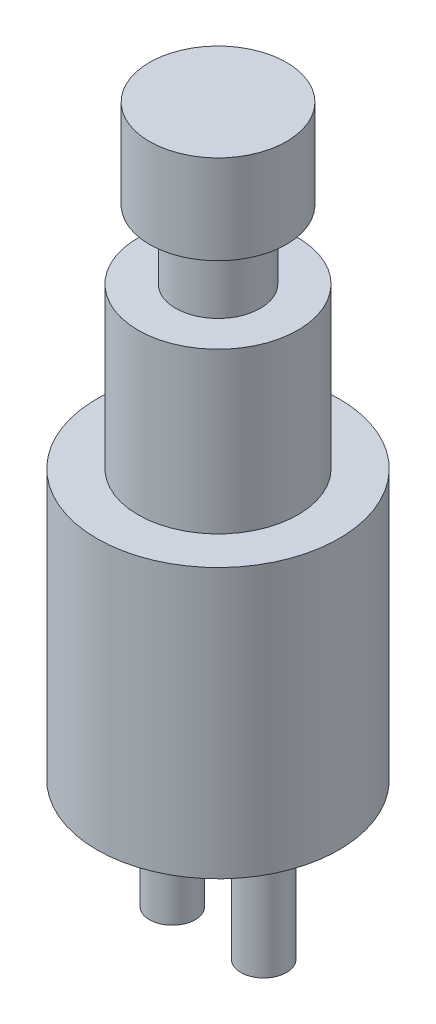
ISO-10303-21;
HEADER;
FILE_DESCRIPTION(('STEP AP214'),'2;1');
FILE_NAME('part.step','',(''),(''),'','','');
FILE_SCHEMA(('AUTOMOTIVE_DESIGN { 1 0 10303 214 1 1 1 1 }'));
ENDSEC;
DATA;
#1=APPLICATION_CONTEXT('core data for automotive mechanical design processes');
#2=APPLICATION_PROTOCOL_DEFINITION('international standard','automotive_design',2000,#1);
#3=PRODUCT_CONTEXT('',#1,'mechanical');
#4=PRODUCT('Part','Part','',(#3));
#5=PRODUCT_RELATED_PRODUCT_CATEGORY('part','',(#4));
#6=PRODUCT_DEFINITION_FORMATION('','',#4);
#7=PRODUCT_DEFINITION_CONTEXT('part definition',#1,'design');
#8=PRODUCT_DEFINITION('design','',#6,#7);
#9=PRODUCT_DEFINITION_SHAPE('','',#8);
#10=(LENGTH_UNIT() NAMED_UNIT(*) SI_UNIT(.MILLI.,.METRE.));
#11=(NAMED_UNIT(*) PLANE_ANGLE_UNIT() SI_UNIT($,.RADIAN.));
#12=(NAMED_UNIT(*) SI_UNIT($,.STERADIAN.) SOLID_ANGLE_UNIT());
#13=UNCERTAINTY_MEASURE_WITH_UNIT(LENGTH_MEASURE(1.E-05),#10,'distance_accuracy_value','');
#14=(GEOMETRIC_REPRESENTATION_CONTEXT(3) GLOBAL_UNCERTAINTY_ASSIGNED_CONTEXT((#13)) GLOBAL_UNIT_ASSIGNED_CONTEXT((#10,
#11,#12)) REPRESENTATION_CONTEXT('',''));
#15=CARTESIAN_POINT('',(0.,0.,0.));
#16=DIRECTION('',(0.,0.,1.));
#17=DIRECTION('',(1.,0.,0.));
#18=AXIS2_PLACEMENT_3D('',#15,#16,#17);
#19=CARTESIAN_POINT('',(0.,0.,0.));
#20=DIRECTION('',(0.,1.,0.));
#21=DIRECTION('',(0.,0.,1.));
#22=AXIS2_PLACEMENT_3D('',#19,#20,#21);
#23=PLANE('',#22);
#24=CARTESIAN_POINT('',(-2.,0.,0.));
#25=DIRECTION('',(0.,1.,0.));
#26=DIRECTION('',(0.,0.,1.));
#27=AXIS2_PLACEMENT_3D('',#24,#25,#26);
#28=CIRCLE('',#27,1.);
#29=CARTESIAN_POINT('',(-2.,0.,1.));
#30=VERTEX_POINT('',#29);
#31=EDGE_CURVE('E38',#30,#30,#28,.F.);
#32=ORIENTED_EDGE('',*,*,#31,.F.);
#33=EDGE_LOOP('',(#32));
#34=FACE_BOUND('',#33,.T.);
#35=CARTESIAN_POINT('',(0.,0.,0.));
#36=DIRECTION('',(0.,1.,0.));
#37=DIRECTION('',(0.,0.,1.));
#38=AXIS2_PLACEMENT_3D('',#35,#36,#37);
#39=CIRCLE('',#38,5.3);
#40=CARTESIAN_POINT('',(0.,0.,5.3));
#41=VERTEX_POINT('',#40);
#42=EDGE_CURVE('E46',#41,#41,#39,.T.);
#43=ORIENTED_EDGE('',*,*,#42,.F.);
#44=EDGE_LOOP('',(#43));
#45=FACE_BOUND('',#44,.T.);
#46=CARTESIAN_POINT('',(2.,0.,0.));
#47=DIRECTION('',(0.,1.,0.));
#48=DIRECTION('',(0.,0.,1.));
#49=AXIS2_PLACEMENT_3D('',#46,#47,#48);
#50=CIRCLE('',#49,1.);
#51=CARTESIAN_POINT('',(2.,0.,1.));
#52=VERTEX_POINT('',#51);
#53=EDGE_CURVE('E10',#52,#52,#50,.F.);
#54=ORIENTED_EDGE('',*,*,#53,.F.);
#55=EDGE_LOOP('',(#54));
#56=FACE_BOUND('',#55,.T.);
#57=ADVANCED_FACE('F31',(#34,#45,#56),#23,.F.);
#58=CARTESIAN_POINT('',(0.,18.8,0.));
#59=DIRECTION('',(0.,1.,0.));
#60=DIRECTION('',(0.,0.,1.));
#61=AXIS2_PLACEMENT_3D('',#58,#59,#60);
#62=PLANE('',#61);
#63=CARTESIAN_POINT('',(0.,18.8,0.));
#64=DIRECTION('',(0.,1.,0.));
#65=DIRECTION('',(0.,0.,1.));
#66=AXIS2_PLACEMENT_3D('',#63,#64,#65);
#67=CIRCLE('',#66,3.5);
#68=CARTESIAN_POINT('',(0.,18.8,3.5));
#69=VERTEX_POINT('',#68);
#70=EDGE_CURVE('E50',#69,#69,#67,.T.);
#71=ORIENTED_EDGE('',*,*,#70,.T.);
#72=EDGE_LOOP('',(#71));
#73=FACE_BOUND('',#72,.T.);
#74=CARTESIAN_POINT('',(0.,18.8,0.));
#75=DIRECTION('',(0.,1.,0.));
#76=DIRECTION('',(0.,0.,1.));
#77=AXIS2_PLACEMENT_3D('',#74,#75,#76);
#78=CIRCLE('',#77,1.85);
#79=CARTESIAN_POINT('',(0.,18.8,1.85));
#80=VERTEX_POINT('',#79);
#81=EDGE_CURVE('E58',#80,#80,#78,.T.);
#82=ORIENTED_EDGE('',*,*,#81,.F.);
#83=EDGE_LOOP('',(#82));
#84=FACE_BOUND('',#83,.T.);
#85=ADVANCED_FACE('F91',(#73,#84),#62,.T.);
#86=CARTESIAN_POINT('',(0.,11.8,0.));
#87=DIRECTION('',(0.,1.,0.));
#88=DIRECTION('',(0.,0.,1.));
#89=AXIS2_PLACEMENT_3D('',#86,#87,#88);
#90=PLANE('',#89);
#91=CARTESIAN_POINT('',(0.,11.8,0.));
#92=DIRECTION('',(0.,1.,0.));
#93=DIRECTION('',(0.,0.,1.));
#94=AXIS2_PLACEMENT_3D('',#91,#92,#93);
#95=CIRCLE('',#94,5.3);
#96=CARTESIAN_POINT('',(0.,11.8,5.3));
#97=VERTEX_POINT('',#96);
#98=EDGE_CURVE('E42',#97,#97,#95,.T.);
#99=ORIENTED_EDGE('',*,*,#98,.T.);
#100=EDGE_LOOP('',(#99));
#101=FACE_BOUND('',#100,.T.);
#102=CARTESIAN_POINT('',(0.,11.8,0.));
#103=DIRECTION('',(0.,1.,0.));
#104=DIRECTION('',(0.,0.,1.));
#105=AXIS2_PLACEMENT_3D('',#102,#103,#104);
#106=CIRCLE('',#105,3.5);
#107=CARTESIAN_POINT('',(0.,11.8,3.5));
#108=VERTEX_POINT('',#107);
#109=EDGE_CURVE('E52',#108,#108,#106,.T.);
#110=ORIENTED_EDGE('',*,*,#109,.F.);
#111=EDGE_LOOP('',(#110));
#112=FACE_BOUND('',#111,.T.);
#113=ADVANCED_FACE('F98',(#101,#112),#90,.T.);
#114=CARTESIAN_POINT('',(0.,11.8,0.));
#115=DIRECTION('',(0.,-1.,0.));
#116=DIRECTION('',(0.,0.,-1.));
#117=AXIS2_PLACEMENT_3D('',#114,#115,#116);
#118=CYLINDRICAL_SURFACE('',#117,5.3);
#119=ORIENTED_EDGE('',*,*,#98,.F.);
#120=EDGE_LOOP('',(#119));
#121=FACE_BOUND('',#120,.T.);
#122=ORIENTED_EDGE('',*,*,#42,.T.);
#123=EDGE_LOOP('',(#122));
#124=FACE_BOUND('',#123,.T.);
#125=ADVANCED_FACE('F33',(#121,#124),#118,.T.);
#126=CARTESIAN_POINT('',(0.,18.8,0.));
#127=DIRECTION('',(0.,-1.,0.));
#128=DIRECTION('',(0.,0.,-1.));
#129=AXIS2_PLACEMENT_3D('',#126,#127,#128);
#130=CYLINDRICAL_SURFACE('',#129,3.5);
#131=ORIENTED_EDGE('',*,*,#70,.F.);
#132=EDGE_LOOP('',(#131));
#133=FACE_BOUND('',#132,.T.);
#134=ORIENTED_EDGE('',*,*,#109,.T.);
#135=EDGE_LOOP('',(#134));
#136=FACE_BOUND('',#135,.T.);
#137=ADVANCED_FACE('F106',(#133,#136),#130,.T.);
#138=CARTESIAN_POINT('',(0.,21.8,0.));
#139=DIRECTION('',(0.,-1.,0.));
#140=DIRECTION('',(0.,0.,-1.));
#141=AXIS2_PLACEMENT_3D('',#138,#139,#140);
#142=CYLINDRICAL_SURFACE('',#141,1.85);
#143=CARTESIAN_POINT('',(0.,21.8,0.));
#144=DIRECTION('',(0.,1.,0.));
#145=DIRECTION('',(0.,0.,1.));
#146=AXIS2_PLACEMENT_3D('',#143,#144,#145);
#147=CIRCLE('',#146,1.85);
#148=CARTESIAN_POINT('',(0.,21.8,1.85));
#149=VERTEX_POINT('',#148);
#150=EDGE_CURVE('E55',#149,#149,#147,.T.);
#151=ORIENTED_EDGE('',*,*,#150,.F.);
#152=EDGE_LOOP('',(#151));
#153=FACE_BOUND('',#152,.T.);
#154=ORIENTED_EDGE('',*,*,#81,.T.);
#155=EDGE_LOOP('',(#154));
#156=FACE_BOUND('',#155,.T.);
#157=ADVANCED_FACE('F108',(#153,#156),#142,.T.);
#158=CARTESIAN_POINT('',(0.,21.8,0.));
#159=DIRECTION('',(0.,1.,0.));
#160=DIRECTION('',(0.,0.,1.));
#161=AXIS2_PLACEMENT_3D('',#158,#159,#160);
#162=PLANE('',#161);
#163=CARTESIAN_POINT('',(0.,21.8,0.));
#164=DIRECTION('',(0.,1.,0.));
#165=DIRECTION('',(0.,0.,1.));
#166=AXIS2_PLACEMENT_3D('',#163,#164,#165);
#167=CIRCLE('',#166,3.);
#168=CARTESIAN_POINT('',(0.,21.8,3.));
#169=VERTEX_POINT('',#168);
#170=EDGE_CURVE('E64',#169,#169,#167,.T.);
#171=ORIENTED_EDGE('',*,*,#170,.F.);
#172=EDGE_LOOP('',(#171));
#173=FACE_BOUND('',#172,.T.);
#174=ORIENTED_EDGE('',*,*,#150,.T.);
#175=EDGE_LOOP('',(#174));
#176=FACE_BOUND('',#175,.T.);
#177=ADVANCED_FACE('F113',(#173,#176),#162,.F.);
#178=CARTESIAN_POINT('',(0.,25.7,0.));
#179=DIRECTION('',(0.,-1.,0.));
#180=DIRECTION('',(0.,0.,-1.));
#181=AXIS2_PLACEMENT_3D('',#178,#179,#180);
#182=CYLINDRICAL_SURFACE('',#181,3.);
#183=CARTESIAN_POINT('',(0.,25.7,0.));
#184=DIRECTION('',(0.,1.,0.));
#185=DIRECTION('',(0.,0.,1.));
#186=AXIS2_PLACEMENT_3D('',#183,#184,#185);
#187=CIRCLE('',#186,3.);
#188=CARTESIAN_POINT('',(0.,25.7,3.));
#189=VERTEX_POINT('',#188);
#190=EDGE_CURVE('E61',#189,#189,#187,.T.);
#191=ORIENTED_EDGE('',*,*,#190,.F.);
#192=EDGE_LOOP('',(#191));
#193=FACE_BOUND('',#192,.T.);
#194=ORIENTED_EDGE('',*,*,#170,.T.);
#195=EDGE_LOOP('',(#194));
#196=FACE_BOUND('',#195,.T.);
#197=ADVANCED_FACE('F115',(#193,#196),#182,.T.);
#198=CARTESIAN_POINT('',(0.,25.7,0.));
#199=DIRECTION('',(0.,1.,0.));
#200=DIRECTION('',(0.,0.,1.));
#201=AXIS2_PLACEMENT_3D('',#198,#199,#200);
#202=PLANE('',#201);
#203=ORIENTED_EDGE('',*,*,#190,.T.);
#204=EDGE_LOOP('',(#203));
#205=FACE_BOUND('',#204,.T.);
#206=ADVANCED_FACE('F118',(#205),#202,.T.);
#207=CARTESIAN_POINT('',(-2.,-5.8,0.));
#208=DIRECTION('',(0.,1.,0.));
#209=DIRECTION('',(0.,0.,1.));
#210=AXIS2_PLACEMENT_3D('',#207,#208,#209);
#211=CYLINDRICAL_SURFACE('',#210,1.);
#212=CARTESIAN_POINT('',(-2.,-5.8,0.));
#213=DIRECTION('',(0.,-1.,0.));
#214=DIRECTION('',(0.,0.,-1.));
#215=AXIS2_PLACEMENT_3D('',#212,#213,#214);
#216=CIRCLE('',#215,1.);
#217=CARTESIAN_POINT('',(-2.,-5.8,-1.));
#218=VERTEX_POINT('',#217);
#219=EDGE_CURVE('E67',#218,#218,#216,.T.);
#220=ORIENTED_EDGE('',*,*,#219,.F.);
#221=EDGE_LOOP('',(#220));
#222=FACE_BOUND('',#221,.T.);
#223=ORIENTED_EDGE('',*,*,#31,.T.);
#224=EDGE_LOOP('',(#223));
#225=FACE_BOUND('',#224,.T.);
#226=ADVANCED_FACE('F87',(#222,#225),#211,.T.);
#227=CARTESIAN_POINT('',(-2.,-5.8,0.));
#228=DIRECTION('',(0.,-1.,0.));
#229=DIRECTION('',(0.,0.,-1.));
#230=AXIS2_PLACEMENT_3D('',#227,#228,#229);
#231=PLANE('',#230);
#232=ORIENTED_EDGE('',*,*,#219,.T.);
#233=EDGE_LOOP('',(#232));
#234=FACE_BOUND('',#233,.T.);
#235=ADVANCED_FACE('F80',(#234),#231,.T.);
#236=CARTESIAN_POINT('',(2.,-5.8,0.));
#237=DIRECTION('',(0.,1.,0.));
#238=DIRECTION('',(0.,0.,1.));
#239=AXIS2_PLACEMENT_3D('',#236,#237,#238);
#240=CYLINDRICAL_SURFACE('',#239,1.);
#241=CARTESIAN_POINT('',(2.,-5.8,0.));
#242=DIRECTION('',(0.,-1.,0.));
#243=DIRECTION('',(0.,0.,-1.));
#244=AXIS2_PLACEMENT_3D('',#241,#242,#243);
#245=CIRCLE('',#244,1.);
#246=CARTESIAN_POINT('',(2.,-5.8,-1.));
#247=VERTEX_POINT('',#246);
#248=EDGE_CURVE('E72',#247,#247,#245,.T.);
#249=ORIENTED_EDGE('',*,*,#248,.F.);
#250=EDGE_LOOP('',(#249));
#251=FACE_BOUND('',#250,.T.);
#252=ORIENTED_EDGE('',*,*,#53,.T.);
#253=EDGE_LOOP('',(#252));
#254=FACE_BOUND('',#253,.T.);
#255=ADVANCED_FACE('F78',(#251,#254),#240,.T.);
#256=CARTESIAN_POINT('',(2.,-5.8,0.));
#257=DIRECTION('',(0.,-1.,0.));
#258=DIRECTION('',(0.,0.,-1.));
#259=AXIS2_PLACEMENT_3D('',#256,#257,#258);
#260=PLANE('',#259);
#261=ORIENTED_EDGE('',*,*,#248,.T.);
#262=EDGE_LOOP('',(#261));
#263=FACE_BOUND('',#262,.T.);
#264=ADVANCED_FACE('F76',(#263),#260,.T.);
#265=CLOSED_SHELL('',(#57,#85,#113,#125,#137,#157,#177,#197,#206,#226,#235,#255,#264));
#266=MANIFOLD_SOLID_BREP('B2',#265);
#267=ADVANCED_BREP_SHAPE_REPRESENTATION('',(#18,#266),#14);
#268=SHAPE_DEFINITION_REPRESENTATION(#9,#267);
ENDSEC;
END-ISO-10303-21;
